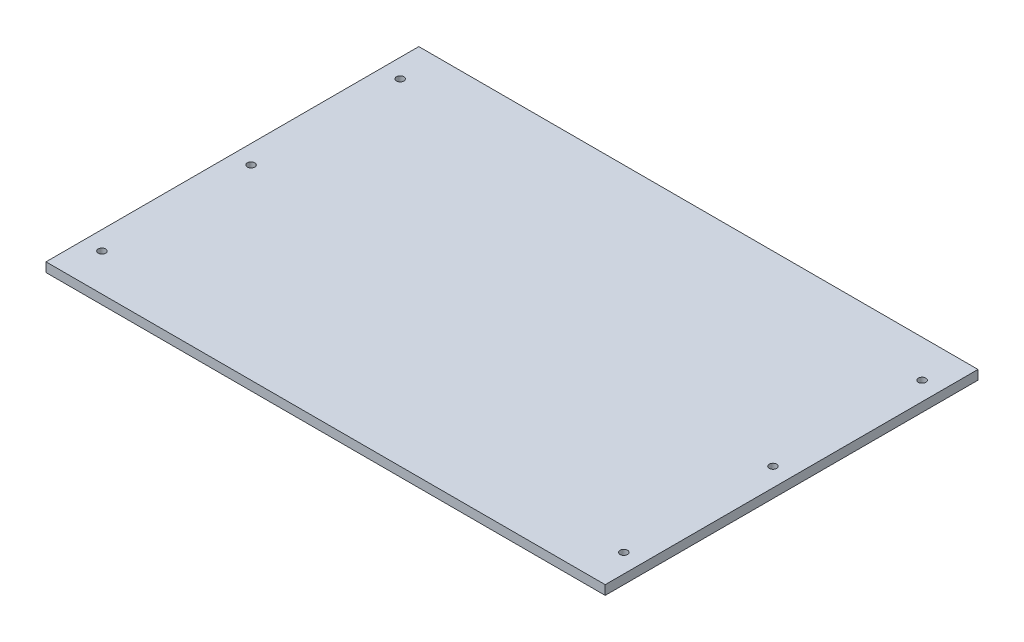
ISO-10303-21;
HEADER;
FILE_DESCRIPTION(('STEP AP214'),'2;1');
FILE_NAME('part.step','',(''),(''),'','','');
FILE_SCHEMA(('AUTOMOTIVE_DESIGN { 1 0 10303 214 1 1 1 1 }'));
ENDSEC;
DATA;
#1=APPLICATION_CONTEXT('core data for automotive mechanical design processes');
#2=APPLICATION_PROTOCOL_DEFINITION('international standard','automotive_design',2000,#1);
#3=PRODUCT_CONTEXT('',#1,'mechanical');
#4=PRODUCT('Part','Part','',(#3));
#5=PRODUCT_RELATED_PRODUCT_CATEGORY('part','',(#4));
#6=PRODUCT_DEFINITION_FORMATION('','',#4);
#7=PRODUCT_DEFINITION_CONTEXT('part definition',#1,'design');
#8=PRODUCT_DEFINITION('design','',#6,#7);
#9=PRODUCT_DEFINITION_SHAPE('','',#8);
#10=(LENGTH_UNIT() NAMED_UNIT(*) SI_UNIT(.MILLI.,.METRE.));
#11=(NAMED_UNIT(*) PLANE_ANGLE_UNIT() SI_UNIT($,.RADIAN.));
#12=(NAMED_UNIT(*) SI_UNIT($,.STERADIAN.) SOLID_ANGLE_UNIT());
#13=UNCERTAINTY_MEASURE_WITH_UNIT(LENGTH_MEASURE(1.E-05),#10,'distance_accuracy_value','');
#14=(GEOMETRIC_REPRESENTATION_CONTEXT(3) GLOBAL_UNCERTAINTY_ASSIGNED_CONTEXT((#13)) GLOBAL_UNIT_ASSIGNED_CONTEXT((#10,
#11,#12)) REPRESENTATION_CONTEXT('',''));
#15=CARTESIAN_POINT('',(0.,0.,0.));
#16=DIRECTION('',(0.,0.,1.));
#17=DIRECTION('',(1.,0.,0.));
#18=AXIS2_PLACEMENT_3D('',#15,#16,#17);
#19=CARTESIAN_POINT('',(0.,5.,0.));
#20=DIRECTION('',(0.,-1.,0.));
#21=DIRECTION('',(0.,0.,-1.));
#22=AXIS2_PLACEMENT_3D('',#19,#20,#21);
#23=PLANE('',#22);
#24=DIRECTION('',(0.,0.,-1.));
#25=VECTOR('',#24,1.);
#26=CARTESIAN_POINT('',(150.,5.,100.));
#27=LINE('',#26,#25);
#28=CARTESIAN_POINT('',(150.,5.,100.));
#29=VERTEX_POINT('',#28);
#30=CARTESIAN_POINT('',(150.,5.,-100.));
#31=VERTEX_POINT('',#30);
#32=EDGE_CURVE('E91',#29,#31,#27,.T.);
#33=ORIENTED_EDGE('',*,*,#32,.T.);
#34=DIRECTION('',(-1.,0.,0.));
#35=VECTOR('',#34,1.);
#36=CARTESIAN_POINT('',(-150.,5.,-100.));
#37=LINE('',#36,#35);
#38=CARTESIAN_POINT('',(-150.,5.,-100.));
#39=VERTEX_POINT('',#38);
#40=EDGE_CURVE('E86',#31,#39,#37,.T.);
#41=ORIENTED_EDGE('',*,*,#40,.T.);
#42=DIRECTION('',(0.,0.,1.));
#43=VECTOR('',#42,1.);
#44=CARTESIAN_POINT('',(-150.,5.,100.));
#45=LINE('',#44,#43);
#46=CARTESIAN_POINT('',(-150.,5.,100.));
#47=VERTEX_POINT('',#46);
#48=EDGE_CURVE('E89',#39,#47,#45,.T.);
#49=ORIENTED_EDGE('',*,*,#48,.T.);
#50=DIRECTION('',(1.,0.,0.));
#51=VECTOR('',#50,1.);
#52=CARTESIAN_POINT('',(-150.,5.,100.));
#53=LINE('',#52,#51);
#54=EDGE_CURVE('E56',#47,#29,#53,.T.);
#55=ORIENTED_EDGE('',*,*,#54,.T.);
#56=EDGE_LOOP('',(#33,#41,#49,#55));
#57=FACE_BOUND('',#56,.T.);
#58=CARTESIAN_POINT('',(-140.,5.,-80.));
#59=DIRECTION('',(0.,1.,0.));
#60=DIRECTION('',(0.,0.,1.));
#61=AXIS2_PLACEMENT_3D('',#58,#59,#60);
#62=CIRCLE('',#61,2.);
#63=CARTESIAN_POINT('',(-140.,5.,-78.));
#64=VERTEX_POINT('',#63);
#65=EDGE_CURVE('E106',#64,#64,#62,.T.);
#66=ORIENTED_EDGE('',*,*,#65,.F.);
#67=EDGE_LOOP('',(#66));
#68=FACE_BOUND('',#67,.T.);
#69=CARTESIAN_POINT('',(-140.,5.,80.));
#70=DIRECTION('',(0.,1.,0.));
#71=DIRECTION('',(0.,0.,-1.));
#72=AXIS2_PLACEMENT_3D('',#69,#70,#71);
#73=CIRCLE('',#72,2.);
#74=CARTESIAN_POINT('',(-140.,5.,78.));
#75=VERTEX_POINT('',#74);
#76=EDGE_CURVE('E121',#75,#75,#73,.T.);
#77=ORIENTED_EDGE('',*,*,#76,.F.);
#78=EDGE_LOOP('',(#77));
#79=FACE_BOUND('',#78,.T.);
#80=CARTESIAN_POINT('',(-140.,5.,0.));
#81=DIRECTION('',(0.,1.,0.));
#82=DIRECTION('',(0.,0.,1.));
#83=AXIS2_PLACEMENT_3D('',#80,#81,#82);
#84=CIRCLE('',#83,2.);
#85=CARTESIAN_POINT('',(-140.,5.,2.));
#86=VERTEX_POINT('',#85);
#87=EDGE_CURVE('E127',#86,#86,#84,.T.);
#88=ORIENTED_EDGE('',*,*,#87,.F.);
#89=EDGE_LOOP('',(#88));
#90=FACE_BOUND('',#89,.T.);
#91=CARTESIAN_POINT('',(140.,5.,80.));
#92=DIRECTION('',(0.,1.,0.));
#93=DIRECTION('',(0.,0.,1.));
#94=AXIS2_PLACEMENT_3D('',#91,#92,#93);
#95=CIRCLE('',#94,2.);
#96=CARTESIAN_POINT('',(140.,5.,82.));
#97=VERTEX_POINT('',#96);
#98=EDGE_CURVE('E133',#97,#97,#95,.T.);
#99=ORIENTED_EDGE('',*,*,#98,.F.);
#100=EDGE_LOOP('',(#99));
#101=FACE_BOUND('',#100,.T.);
#102=CARTESIAN_POINT('',(140.,5.,0.));
#103=DIRECTION('',(0.,1.,0.));
#104=DIRECTION('',(0.,0.,-1.));
#105=AXIS2_PLACEMENT_3D('',#102,#103,#104);
#106=CIRCLE('',#105,2.);
#107=CARTESIAN_POINT('',(140.,5.,-2.));
#108=VERTEX_POINT('',#107);
#109=EDGE_CURVE('E139',#108,#108,#106,.T.);
#110=ORIENTED_EDGE('',*,*,#109,.F.);
#111=EDGE_LOOP('',(#110));
#112=FACE_BOUND('',#111,.T.);
#113=CARTESIAN_POINT('',(140.,5.,-80.));
#114=DIRECTION('',(0.,1.,0.));
#115=DIRECTION('',(0.,0.,-1.));
#116=AXIS2_PLACEMENT_3D('',#113,#114,#115);
#117=CIRCLE('',#116,2.);
#118=CARTESIAN_POINT('',(140.,5.,-82.));
#119=VERTEX_POINT('',#118);
#120=EDGE_CURVE('E145',#119,#119,#117,.T.);
#121=ORIENTED_EDGE('',*,*,#120,.F.);
#122=EDGE_LOOP('',(#121));
#123=FACE_BOUND('',#122,.T.);
#124=ADVANCED_FACE('F39',(#57,#68,#79,#90,#101,#112,#123),#23,.F.);
#125=CARTESIAN_POINT('',(0.,0.,0.));
#126=DIRECTION('',(0.,-1.,0.));
#127=DIRECTION('',(0.,0.,-1.));
#128=AXIS2_PLACEMENT_3D('',#125,#126,#127);
#129=PLANE('',#128);
#130=CARTESIAN_POINT('',(140.,0.,0.));
#131=DIRECTION('',(0.,1.,0.));
#132=DIRECTION('',(0.,0.,-1.));
#133=AXIS2_PLACEMENT_3D('',#130,#131,#132);
#134=CIRCLE('',#133,2.);
#135=CARTESIAN_POINT('',(140.,0.,-2.));
#136=VERTEX_POINT('',#135);
#137=EDGE_CURVE('E142',#136,#136,#134,.T.);
#138=ORIENTED_EDGE('',*,*,#137,.T.);
#139=EDGE_LOOP('',(#138));
#140=FACE_BOUND('',#139,.T.);
#141=CARTESIAN_POINT('',(-140.,0.,0.));
#142=DIRECTION('',(0.,1.,0.));
#143=DIRECTION('',(0.,0.,1.));
#144=AXIS2_PLACEMENT_3D('',#141,#142,#143);
#145=CIRCLE('',#144,2.);
#146=CARTESIAN_POINT('',(-140.,0.,2.));
#147=VERTEX_POINT('',#146);
#148=EDGE_CURVE('E130',#147,#147,#145,.T.);
#149=ORIENTED_EDGE('',*,*,#148,.T.);
#150=EDGE_LOOP('',(#149));
#151=FACE_BOUND('',#150,.T.);
#152=CARTESIAN_POINT('',(-140.,0.,-80.));
#153=DIRECTION('',(0.,1.,0.));
#154=DIRECTION('',(0.,0.,1.));
#155=AXIS2_PLACEMENT_3D('',#152,#153,#154);
#156=CIRCLE('',#155,2.);
#157=CARTESIAN_POINT('',(-140.,0.,-78.));
#158=VERTEX_POINT('',#157);
#159=EDGE_CURVE('E118',#158,#158,#156,.T.);
#160=ORIENTED_EDGE('',*,*,#159,.T.);
#161=EDGE_LOOP('',(#160));
#162=FACE_BOUND('',#161,.T.);
#163=DIRECTION('',(0.,0.,-1.));
#164=VECTOR('',#163,1.);
#165=CARTESIAN_POINT('',(150.,0.,100.));
#166=LINE('',#165,#164);
#167=CARTESIAN_POINT('',(150.,0.,100.));
#168=VERTEX_POINT('',#167);
#169=CARTESIAN_POINT('',(150.,0.,-100.));
#170=VERTEX_POINT('',#169);
#171=EDGE_CURVE('E103',#168,#170,#166,.T.);
#172=ORIENTED_EDGE('',*,*,#171,.F.);
#173=DIRECTION('',(1.,0.,0.));
#174=VECTOR('',#173,1.);
#175=CARTESIAN_POINT('',(-150.,0.,100.));
#176=LINE('',#175,#174);
#177=CARTESIAN_POINT('',(-150.,0.,100.));
#178=VERTEX_POINT('',#177);
#179=EDGE_CURVE('E79',#178,#168,#176,.T.);
#180=ORIENTED_EDGE('',*,*,#179,.F.);
#181=DIRECTION('',(0.,0.,1.));
#182=VECTOR('',#181,1.);
#183=CARTESIAN_POINT('',(-150.,0.,100.));
#184=LINE('',#183,#182);
#185=CARTESIAN_POINT('',(-150.,0.,-100.));
#186=VERTEX_POINT('',#185);
#187=EDGE_CURVE('E73',#186,#178,#184,.T.);
#188=ORIENTED_EDGE('',*,*,#187,.F.);
#189=DIRECTION('',(-1.,0.,0.));
#190=VECTOR('',#189,1.);
#191=CARTESIAN_POINT('',(-150.,0.,-100.));
#192=LINE('',#191,#190);
#193=EDGE_CURVE('E95',#170,#186,#192,.T.);
#194=ORIENTED_EDGE('',*,*,#193,.F.);
#195=EDGE_LOOP('',(#172,#180,#188,#194));
#196=FACE_BOUND('',#195,.T.);
#197=CARTESIAN_POINT('',(-140.,0.,80.));
#198=DIRECTION('',(0.,1.,0.));
#199=DIRECTION('',(0.,0.,-1.));
#200=AXIS2_PLACEMENT_3D('',#197,#198,#199);
#201=CIRCLE('',#200,2.);
#202=CARTESIAN_POINT('',(-140.,0.,78.));
#203=VERTEX_POINT('',#202);
#204=EDGE_CURVE('E124',#203,#203,#201,.T.);
#205=ORIENTED_EDGE('',*,*,#204,.T.);
#206=EDGE_LOOP('',(#205));
#207=FACE_BOUND('',#206,.T.);
#208=CARTESIAN_POINT('',(140.,0.,80.));
#209=DIRECTION('',(0.,1.,0.));
#210=DIRECTION('',(0.,0.,1.));
#211=AXIS2_PLACEMENT_3D('',#208,#209,#210);
#212=CIRCLE('',#211,2.);
#213=CARTESIAN_POINT('',(140.,0.,82.));
#214=VERTEX_POINT('',#213);
#215=EDGE_CURVE('E136',#214,#214,#212,.T.);
#216=ORIENTED_EDGE('',*,*,#215,.T.);
#217=EDGE_LOOP('',(#216));
#218=FACE_BOUND('',#217,.T.);
#219=CARTESIAN_POINT('',(140.,0.,-80.));
#220=DIRECTION('',(0.,1.,0.));
#221=DIRECTION('',(0.,0.,-1.));
#222=AXIS2_PLACEMENT_3D('',#219,#220,#221);
#223=CIRCLE('',#222,2.);
#224=CARTESIAN_POINT('',(140.,0.,-82.));
#225=VERTEX_POINT('',#224);
#226=EDGE_CURVE('E148',#225,#225,#223,.T.);
#227=ORIENTED_EDGE('',*,*,#226,.T.);
#228=EDGE_LOOP('',(#227));
#229=FACE_BOUND('',#228,.T.);
#230=ADVANCED_FACE('F114',(#140,#151,#162,#196,#207,#218,#229),#129,.T.);
#231=CARTESIAN_POINT('',(150.,5.,100.));
#232=DIRECTION('',(-1.,0.,0.));
#233=DIRECTION('',(0.,0.,1.));
#234=AXIS2_PLACEMENT_3D('',#231,#232,#233);
#235=PLANE('',#234);
#236=ORIENTED_EDGE('',*,*,#171,.T.);
#237=DIRECTION('',(0.,-1.,0.));
#238=VECTOR('',#237,1.);
#239=CARTESIAN_POINT('',(150.,5.,-100.));
#240=LINE('',#239,#238);
#241=EDGE_CURVE('E11',#31,#170,#240,.T.);
#242=ORIENTED_EDGE('',*,*,#241,.F.);
#243=ORIENTED_EDGE('',*,*,#32,.F.);
#244=DIRECTION('',(0.,-1.,0.));
#245=VECTOR('',#244,1.);
#246=CARTESIAN_POINT('',(150.,5.,100.));
#247=LINE('',#246,#245);
#248=EDGE_CURVE('E99',#29,#168,#247,.T.);
#249=ORIENTED_EDGE('',*,*,#248,.T.);
#250=EDGE_LOOP('',(#236,#242,#243,#249));
#251=FACE_BOUND('',#250,.T.);
#252=ADVANCED_FACE('F41',(#251),#235,.F.);
#253=CARTESIAN_POINT('',(-150.,5.,-100.));
#254=DIRECTION('',(0.,0.,1.));
#255=DIRECTION('',(1.,0.,0.));
#256=AXIS2_PLACEMENT_3D('',#253,#254,#255);
#257=PLANE('',#256);
#258=ORIENTED_EDGE('',*,*,#193,.T.);
#259=DIRECTION('',(0.,-1.,0.));
#260=VECTOR('',#259,1.);
#261=CARTESIAN_POINT('',(-150.,5.,-100.));
#262=LINE('',#261,#260);
#263=EDGE_CURVE('E48',#39,#186,#262,.T.);
#264=ORIENTED_EDGE('',*,*,#263,.F.);
#265=ORIENTED_EDGE('',*,*,#40,.F.);
#266=ORIENTED_EDGE('',*,*,#241,.T.);
#267=EDGE_LOOP('',(#258,#264,#265,#266));
#268=FACE_BOUND('',#267,.T.);
#269=ADVANCED_FACE('F94',(#268),#257,.F.);
#270=CARTESIAN_POINT('',(-150.,5.,100.));
#271=DIRECTION('',(1.,0.,0.));
#272=DIRECTION('',(0.,0.,-1.));
#273=AXIS2_PLACEMENT_3D('',#270,#271,#272);
#274=PLANE('',#273);
#275=ORIENTED_EDGE('',*,*,#187,.T.);
#276=DIRECTION('',(0.,-1.,0.));
#277=VECTOR('',#276,1.);
#278=CARTESIAN_POINT('',(-150.,5.,100.));
#279=LINE('',#278,#277);
#280=EDGE_CURVE('E96',#47,#178,#279,.T.);
#281=ORIENTED_EDGE('',*,*,#280,.F.);
#282=ORIENTED_EDGE('',*,*,#48,.F.);
#283=ORIENTED_EDGE('',*,*,#263,.T.);
#284=EDGE_LOOP('',(#275,#281,#282,#283));
#285=FACE_BOUND('',#284,.T.);
#286=ADVANCED_FACE('F97',(#285),#274,.F.);
#287=CARTESIAN_POINT('',(-150.,5.,100.));
#288=DIRECTION('',(0.,0.,-1.));
#289=DIRECTION('',(-1.,0.,0.));
#290=AXIS2_PLACEMENT_3D('',#287,#288,#289);
#291=PLANE('',#290);
#292=ORIENTED_EDGE('',*,*,#179,.T.);
#293=ORIENTED_EDGE('',*,*,#248,.F.);
#294=ORIENTED_EDGE('',*,*,#54,.F.);
#295=ORIENTED_EDGE('',*,*,#280,.T.);
#296=EDGE_LOOP('',(#292,#293,#294,#295));
#297=FACE_BOUND('',#296,.T.);
#298=ADVANCED_FACE('F111',(#297),#291,.F.);
#299=CARTESIAN_POINT('',(-140.,5.,-80.));
#300=DIRECTION('',(0.,-1.,0.));
#301=DIRECTION('',(0.,0.,-1.));
#302=AXIS2_PLACEMENT_3D('',#299,#300,#301);
#303=CYLINDRICAL_SURFACE('',#302,2.);
#304=ORIENTED_EDGE('',*,*,#65,.T.);
#305=EDGE_LOOP('',(#304));
#306=FACE_BOUND('',#305,.T.);
#307=ORIENTED_EDGE('',*,*,#159,.F.);
#308=EDGE_LOOP('',(#307));
#309=FACE_BOUND('',#308,.T.);
#310=ADVANCED_FACE('F165',(#306,#309),#303,.F.);
#311=CARTESIAN_POINT('',(-140.,5.,80.));
#312=DIRECTION('',(0.,-1.,0.));
#313=DIRECTION('',(0.,0.,-1.));
#314=AXIS2_PLACEMENT_3D('',#311,#312,#313);
#315=CYLINDRICAL_SURFACE('',#314,2.);
#316=ORIENTED_EDGE('',*,*,#76,.T.);
#317=EDGE_LOOP('',(#316));
#318=FACE_BOUND('',#317,.T.);
#319=ORIENTED_EDGE('',*,*,#204,.F.);
#320=EDGE_LOOP('',(#319));
#321=FACE_BOUND('',#320,.T.);
#322=ADVANCED_FACE('F219',(#318,#321),#315,.F.);
#323=CARTESIAN_POINT('',(-140.,5.,0.));
#324=DIRECTION('',(0.,-1.,0.));
#325=DIRECTION('',(0.,0.,-1.));
#326=AXIS2_PLACEMENT_3D('',#323,#324,#325);
#327=CYLINDRICAL_SURFACE('',#326,2.);
#328=ORIENTED_EDGE('',*,*,#87,.T.);
#329=EDGE_LOOP('',(#328));
#330=FACE_BOUND('',#329,.T.);
#331=ORIENTED_EDGE('',*,*,#148,.F.);
#332=EDGE_LOOP('',(#331));
#333=FACE_BOUND('',#332,.T.);
#334=ADVANCED_FACE('F228',(#330,#333),#327,.F.);
#335=CARTESIAN_POINT('',(140.,5.,80.));
#336=DIRECTION('',(0.,-1.,0.));
#337=DIRECTION('',(0.,0.,-1.));
#338=AXIS2_PLACEMENT_3D('',#335,#336,#337);
#339=CYLINDRICAL_SURFACE('',#338,2.);
#340=ORIENTED_EDGE('',*,*,#98,.T.);
#341=EDGE_LOOP('',(#340));
#342=FACE_BOUND('',#341,.T.);
#343=ORIENTED_EDGE('',*,*,#215,.F.);
#344=EDGE_LOOP('',(#343));
#345=FACE_BOUND('',#344,.T.);
#346=ADVANCED_FACE('F237',(#342,#345),#339,.F.);
#347=CARTESIAN_POINT('',(140.,5.,0.));
#348=DIRECTION('',(0.,-1.,0.));
#349=DIRECTION('',(0.,0.,-1.));
#350=AXIS2_PLACEMENT_3D('',#347,#348,#349);
#351=CYLINDRICAL_SURFACE('',#350,2.);
#352=ORIENTED_EDGE('',*,*,#109,.T.);
#353=EDGE_LOOP('',(#352));
#354=FACE_BOUND('',#353,.T.);
#355=ORIENTED_EDGE('',*,*,#137,.F.);
#356=EDGE_LOOP('',(#355));
#357=FACE_BOUND('',#356,.T.);
#358=ADVANCED_FACE('F247',(#354,#357),#351,.F.);
#359=CARTESIAN_POINT('',(140.,5.,-80.));
#360=DIRECTION('',(0.,-1.,0.));
#361=DIRECTION('',(0.,0.,-1.));
#362=AXIS2_PLACEMENT_3D('',#359,#360,#361);
#363=CYLINDRICAL_SURFACE('',#362,2.);
#364=ORIENTED_EDGE('',*,*,#120,.T.);
#365=EDGE_LOOP('',(#364));
#366=FACE_BOUND('',#365,.T.);
#367=ORIENTED_EDGE('',*,*,#226,.F.);
#368=EDGE_LOOP('',(#367));
#369=FACE_BOUND('',#368,.T.);
#370=ADVANCED_FACE('F154',(#366,#369),#363,.F.);
#371=CLOSED_SHELL('',(#124,#230,#252,#269,#286,#298,#310,#322,#334,#346,#358,#370));
#372=MANIFOLD_SOLID_BREP('B2',#371);
#373=ADVANCED_BREP_SHAPE_REPRESENTATION('',(#18,#372),#14);
#374=SHAPE_DEFINITION_REPRESENTATION(#9,#373);
ENDSEC;
END-ISO-10303-21;
